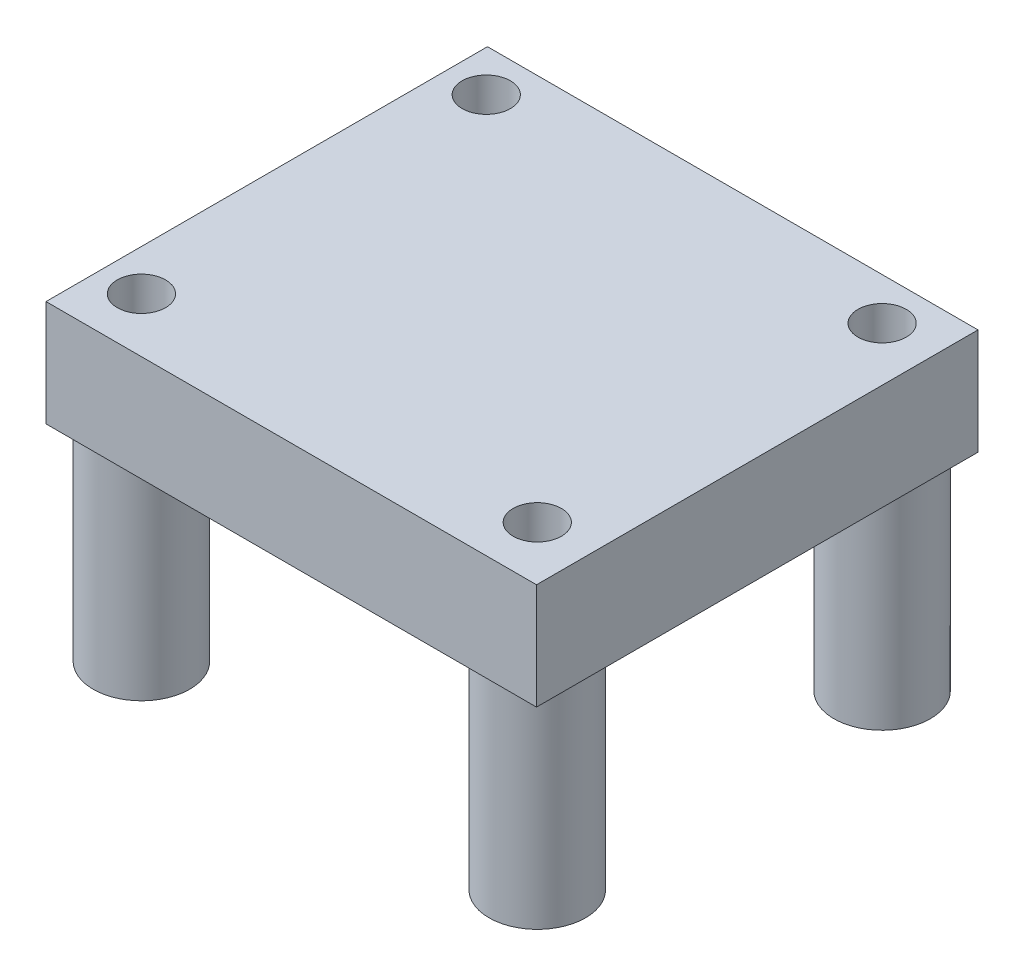
ISO-10303-21;
HEADER;
FILE_DESCRIPTION(('STEP AP214'),'2;1');
FILE_NAME('part.step','',(''),(''),'','','');
FILE_SCHEMA(('AUTOMOTIVE_DESIGN { 1 0 10303 214 1 1 1 1 }'));
ENDSEC;
DATA;
#1=APPLICATION_CONTEXT('core data for automotive mechanical design processes');
#2=APPLICATION_PROTOCOL_DEFINITION('international standard','automotive_design',2000,#1);
#3=PRODUCT_CONTEXT('',#1,'mechanical');
#4=PRODUCT('Part','Part','',(#3));
#5=PRODUCT_RELATED_PRODUCT_CATEGORY('part','',(#4));
#6=PRODUCT_DEFINITION_FORMATION('','',#4);
#7=PRODUCT_DEFINITION_CONTEXT('part definition',#1,'design');
#8=PRODUCT_DEFINITION('design','',#6,#7);
#9=PRODUCT_DEFINITION_SHAPE('','',#8);
#10=(LENGTH_UNIT() NAMED_UNIT(*) SI_UNIT(.MILLI.,.METRE.));
#11=(NAMED_UNIT(*) PLANE_ANGLE_UNIT() SI_UNIT($,.RADIAN.));
#12=(NAMED_UNIT(*) SI_UNIT($,.STERADIAN.) SOLID_ANGLE_UNIT());
#13=UNCERTAINTY_MEASURE_WITH_UNIT(LENGTH_MEASURE(1.E-05),#10,'distance_accuracy_value','');
#14=(GEOMETRIC_REPRESENTATION_CONTEXT(3) GLOBAL_UNCERTAINTY_ASSIGNED_CONTEXT((#13)) GLOBAL_UNIT_ASSIGNED_CONTEXT((#10,
#11,#12)) REPRESENTATION_CONTEXT('',''));
#15=CARTESIAN_POINT('',(0.,0.,0.));
#16=DIRECTION('',(0.,0.,1.));
#17=DIRECTION('',(1.,0.,0.));
#18=AXIS2_PLACEMENT_3D('',#15,#16,#17);
#19=CARTESIAN_POINT('',(0.,0.,0.));
#20=DIRECTION('',(0.,1.,0.));
#21=DIRECTION('',(0.,0.,1.));
#22=AXIS2_PLACEMENT_3D('',#19,#20,#21);
#23=PLANE('',#22);
#24=CARTESIAN_POINT('',(-31.9184975647169,0.,0.511660399212977));
#25=DIRECTION('',(0.,1.,0.));
#26=DIRECTION('',(0.,0.,1.));
#27=AXIS2_PLACEMENT_3D('',#24,#25,#26);
#28=CIRCLE('',#27,2.5);
#29=CARTESIAN_POINT('',(-34.0406995509559,0.,-0.809800432443963));
#30=VERTEX_POINT('',#29);
#31=CARTESIAN_POINT('',(-33.1337246748659,0.,-1.67311031433089));
#32=VERTEX_POINT('',#31);
#33=EDGE_CURVE('E45',#30,#32,#28,.F.);
#34=ORIENTED_EDGE('',*,*,#33,.F.);
#35=DIRECTION('',(0.,0.,1.));
#36=VECTOR('',#35,1.);
#37=CARTESIAN_POINT('',(-34.0406995509559,0.,-1.67311031433089));
#38=LINE('',#37,#36);
#39=CARTESIAN_POINT('',(-34.0406995509559,0.,-1.67311031433089));
#40=VERTEX_POINT('',#39);
#41=EDGE_CURVE('E164',#40,#30,#38,.T.);
#42=ORIENTED_EDGE('',*,*,#41,.F.);
#43=DIRECTION('',(-1.,0.,0.));
#44=VECTOR('',#43,1.);
#45=CARTESIAN_POINT('',(-8.64069955095587,0.,-1.67311031433089));
#46=LINE('',#45,#44);
#47=EDGE_CURVE('E60',#32,#40,#46,.T.);
#48=ORIENTED_EDGE('',*,*,#47,.F.);
#49=EDGE_LOOP('',(#34,#42,#48));
#50=FACE_BOUND('',#49,.T.);
#51=ADVANCED_FACE('F37',(#50),#23,.F.);
#52=CARTESIAN_POINT('',(-8.64069955095587,5.4864,-1.67311031433089));
#53=DIRECTION('',(0.,0.,1.));
#54=DIRECTION('',(1.,0.,0.));
#55=AXIS2_PLACEMENT_3D('',#52,#53,#54);
#56=PLANE('',#55);
#57=CARTESIAN_POINT('',(-8.64069955095587,0.,-1.67311031433089));
#58=VERTEX_POINT('',#57);
#59=CARTESIAN_POINT('',(-10.2054704545679,0.,-1.67311031433089));
#60=VERTEX_POINT('',#59);
#61=EDGE_CURVE('E107',#58,#60,#46,.T.);
#62=ORIENTED_EDGE('',*,*,#61,.T.);
#63=CARTESIAN_POINT('',(-12.6359246748659,0.,-1.67311031433089));
#64=VERTEX_POINT('',#63);
#65=EDGE_CURVE('E103',#60,#64,#46,.T.);
#66=ORIENTED_EDGE('',*,*,#65,.T.);
#67=CARTESIAN_POINT('',(-30.7032704545679,0.,-1.67311031433089));
#68=VERTEX_POINT('',#67);
#69=EDGE_CURVE('E104',#64,#68,#46,.T.);
#70=ORIENTED_EDGE('',*,*,#69,.T.);
#71=EDGE_CURVE('E117',#68,#32,#46,.T.);
#72=ORIENTED_EDGE('',*,*,#71,.T.);
#73=ORIENTED_EDGE('',*,*,#47,.T.);
#74=DIRECTION('',(0.,-1.,0.));
#75=VECTOR('',#74,1.);
#76=CARTESIAN_POINT('',(-34.0406995509559,5.4864,-1.67311031433089));
#77=LINE('',#76,#75);
#78=CARTESIAN_POINT('',(-34.0406995509559,5.4864,-1.67311031433089));
#79=VERTEX_POINT('',#78);
#80=EDGE_CURVE('E180',#79,#40,#77,.T.);
#81=ORIENTED_EDGE('',*,*,#80,.F.);
#82=DIRECTION('',(-1.,0.,0.));
#83=VECTOR('',#82,1.);
#84=CARTESIAN_POINT('',(-8.64069955095587,5.4864,-1.67311031433089));
#85=LINE('',#84,#83);
#86=CARTESIAN_POINT('',(-8.64069955095587,5.4864,-1.67311031433089));
#87=VERTEX_POINT('',#86);
#88=EDGE_CURVE('E152',#87,#79,#85,.T.);
#89=ORIENTED_EDGE('',*,*,#88,.F.);
#90=DIRECTION('',(0.,-1.,0.));
#91=VECTOR('',#90,1.);
#92=CARTESIAN_POINT('',(-8.64069955095587,5.4864,-1.67311031433089));
#93=LINE('',#92,#91);
#94=EDGE_CURVE('E161',#87,#58,#93,.T.);
#95=ORIENTED_EDGE('',*,*,#94,.T.);
#96=EDGE_LOOP('',(#62,#66,#70,#72,#73,#81,#89,#95));
#97=FACE_BOUND('',#96,.T.);
#98=ADVANCED_FACE('F39',(#97),#56,.F.);
#99=CARTESIAN_POINT('',(-34.0406995509559,5.4864,-1.67311031433089));
#100=DIRECTION('',(1.,0.,0.));
#101=DIRECTION('',(0.,0.,-1.));
#102=AXIS2_PLACEMENT_3D('',#99,#100,#101);
#103=PLANE('',#102);
#104=ORIENTED_EDGE('',*,*,#41,.T.);
#105=CARTESIAN_POINT('',(-34.0406995509559,0.,1.83312123086992));
#106=VERTEX_POINT('',#105);
#107=EDGE_CURVE('E168',#30,#106,#38,.T.);
#108=ORIENTED_EDGE('',*,*,#107,.T.);
#109=CARTESIAN_POINT('',(-34.0406995509559,0.,17.046399567556));
#110=VERTEX_POINT('',#109);
#111=EDGE_CURVE('E169',#106,#110,#38,.T.);
#112=ORIENTED_EDGE('',*,*,#111,.T.);
#113=CARTESIAN_POINT('',(-34.0406995509559,0.,19.6893212308699));
#114=VERTEX_POINT('',#113);
#115=EDGE_CURVE('E170',#110,#114,#38,.T.);
#116=ORIENTED_EDGE('',*,*,#115,.T.);
#117=CARTESIAN_POINT('',(-34.0406995509559,0.,21.1868896856691));
#118=VERTEX_POINT('',#117);
#119=EDGE_CURVE('E163',#114,#118,#38,.T.);
#120=ORIENTED_EDGE('',*,*,#119,.T.);
#121=DIRECTION('',(0.,-1.,0.));
#122=VECTOR('',#121,1.);
#123=CARTESIAN_POINT('',(-34.0406995509559,5.4864,21.1868896856691));
#124=LINE('',#123,#122);
#125=CARTESIAN_POINT('',(-34.0406995509559,5.4864,21.1868896856691));
#126=VERTEX_POINT('',#125);
#127=EDGE_CURVE('E177',#126,#118,#124,.T.);
#128=ORIENTED_EDGE('',*,*,#127,.F.);
#129=DIRECTION('',(0.,0.,1.));
#130=VECTOR('',#129,1.);
#131=CARTESIAN_POINT('',(-34.0406995509559,5.4864,-1.67311031433089));
#132=LINE('',#131,#130);
#133=EDGE_CURVE('E155',#79,#126,#132,.T.);
#134=ORIENTED_EDGE('',*,*,#133,.F.);
#135=ORIENTED_EDGE('',*,*,#80,.T.);
#136=EDGE_LOOP('',(#104,#108,#112,#116,#120,#128,#134,#135));
#137=FACE_BOUND('',#136,.T.);
#138=ADVANCED_FACE('F198',(#137),#103,.F.);
#139=CARTESIAN_POINT('',(-34.0406995509559,5.4864,21.1868896856691));
#140=DIRECTION('',(0.,0.,-1.));
#141=DIRECTION('',(-1.,0.,0.));
#142=AXIS2_PLACEMENT_3D('',#139,#140,#141);
#143=PLANE('',#142);
#144=DIRECTION('',(1.,0.,0.));
#145=VECTOR('',#144,1.);
#146=CARTESIAN_POINT('',(-34.0406995509559,0.,21.1868896856691));
#147=LINE('',#146,#145);
#148=CARTESIAN_POINT('',(-8.64069955095587,0.,21.1868896856691));
#149=VERTEX_POINT('',#148);
#150=EDGE_CURVE('E167',#118,#149,#147,.T.);
#151=ORIENTED_EDGE('',*,*,#150,.T.);
#152=DIRECTION('',(0.,-1.,0.));
#153=VECTOR('',#152,1.);
#154=CARTESIAN_POINT('',(-8.64069955095587,5.4864,21.1868896856691));
#155=LINE('',#154,#153);
#156=CARTESIAN_POINT('',(-8.64069955095587,5.4864,21.1868896856691));
#157=VERTEX_POINT('',#156);
#158=EDGE_CURVE('E174',#157,#149,#155,.T.);
#159=ORIENTED_EDGE('',*,*,#158,.F.);
#160=DIRECTION('',(1.,0.,0.));
#161=VECTOR('',#160,1.);
#162=CARTESIAN_POINT('',(-34.0406995509559,5.4864,21.1868896856691));
#163=LINE('',#162,#161);
#164=EDGE_CURVE('E158',#126,#157,#163,.T.);
#165=ORIENTED_EDGE('',*,*,#164,.F.);
#166=ORIENTED_EDGE('',*,*,#127,.T.);
#167=EDGE_LOOP('',(#151,#159,#165,#166));
#168=FACE_BOUND('',#167,.T.);
#169=ADVANCED_FACE('F219',(#168),#143,.F.);
#170=CARTESIAN_POINT('',(-8.64069955095587,5.4864,21.1868896856691));
#171=DIRECTION('',(-1.,0.,0.));
#172=DIRECTION('',(0.,0.,1.));
#173=AXIS2_PLACEMENT_3D('',#170,#171,#172);
#174=PLANE('',#173);
#175=DIRECTION('',(0.,0.,-1.));
#176=VECTOR('',#175,1.);
#177=CARTESIAN_POINT('',(-8.64069955095587,0.,21.1868896856691));
#178=LINE('',#177,#176);
#179=EDGE_CURVE('E156',#149,#58,#178,.T.);
#180=ORIENTED_EDGE('',*,*,#179,.T.);
#181=ORIENTED_EDGE('',*,*,#94,.F.);
#182=DIRECTION('',(0.,0.,-1.));
#183=VECTOR('',#182,1.);
#184=CARTESIAN_POINT('',(-8.64069955095587,5.4864,21.1868896856691));
#185=LINE('',#184,#183);
#186=EDGE_CURVE('E160',#157,#87,#185,.T.);
#187=ORIENTED_EDGE('',*,*,#186,.F.);
#188=ORIENTED_EDGE('',*,*,#158,.T.);
#189=EDGE_LOOP('',(#180,#181,#187,#188));
#190=FACE_BOUND('',#189,.T.);
#191=ADVANCED_FACE('F216',(#190),#174,.F.);
#192=CARTESIAN_POINT('',(0.,5.4864,0.));
#193=DIRECTION('',(0.,1.,0.));
#194=DIRECTION('',(0.,0.,1.));
#195=AXIS2_PLACEMENT_3D('',#192,#193,#194);
#196=PLANE('',#195);
#197=CARTESIAN_POINT('',(-31.9184975647169,5.4864,18.367860399213));
#198=DIRECTION('',(0.,1.,0.));
#199=DIRECTION('',(0.,0.,1.));
#200=AXIS2_PLACEMENT_3D('',#197,#198,#199);
#201=CIRCLE('',#200,1.25);
#202=CARTESIAN_POINT('',(-31.9184975647169,5.4864,19.617860399213));
#203=VERTEX_POINT('',#202);
#204=EDGE_CURVE('E303',#203,#203,#201,.T.);
#205=ORIENTED_EDGE('',*,*,#204,.F.);
#206=EDGE_LOOP('',(#205));
#207=FACE_BOUND('',#206,.T.);
#208=CARTESIAN_POINT('',(-11.4206975647169,5.4864,18.367860399213));
#209=DIRECTION('',(0.,1.,0.));
#210=DIRECTION('',(0.,0.,1.));
#211=AXIS2_PLACEMENT_3D('',#208,#209,#210);
#212=CIRCLE('',#211,1.25);
#213=CARTESIAN_POINT('',(-11.4206975647169,5.4864,19.617860399213));
#214=VERTEX_POINT('',#213);
#215=EDGE_CURVE('E314',#214,#214,#212,.T.);
#216=ORIENTED_EDGE('',*,*,#215,.F.);
#217=EDGE_LOOP('',(#216));
#218=FACE_BOUND('',#217,.T.);
#219=CARTESIAN_POINT('',(-11.4206975647169,5.4864,0.511660399212977));
#220=DIRECTION('',(0.,1.,0.));
#221=DIRECTION('',(0.,0.,1.));
#222=AXIS2_PLACEMENT_3D('',#219,#220,#221);
#223=CIRCLE('',#222,1.25);
#224=CARTESIAN_POINT('',(-11.4206975647169,5.4864,1.76166039921298));
#225=VERTEX_POINT('',#224);
#226=EDGE_CURVE('E309',#225,#225,#223,.T.);
#227=ORIENTED_EDGE('',*,*,#226,.F.);
#228=EDGE_LOOP('',(#227));
#229=FACE_BOUND('',#228,.T.);
#230=CARTESIAN_POINT('',(-31.9184975647169,5.4864,0.511660399212977));
#231=DIRECTION('',(0.,1.,0.));
#232=DIRECTION('',(0.,0.,1.));
#233=AXIS2_PLACEMENT_3D('',#230,#231,#232);
#234=CIRCLE('',#233,1.25);
#235=CARTESIAN_POINT('',(-31.9184975647169,5.4864,1.76166039921298));
#236=VERTEX_POINT('',#235);
#237=EDGE_CURVE('E305',#236,#236,#234,.T.);
#238=ORIENTED_EDGE('',*,*,#237,.F.);
#239=EDGE_LOOP('',(#238));
#240=FACE_BOUND('',#239,.T.);
#241=ORIENTED_EDGE('',*,*,#88,.T.);
#242=ORIENTED_EDGE('',*,*,#133,.T.);
#243=ORIENTED_EDGE('',*,*,#164,.T.);
#244=ORIENTED_EDGE('',*,*,#186,.T.);
#245=EDGE_LOOP('',(#241,#242,#243,#244));
#246=FACE_BOUND('',#245,.T.);
#247=ADVANCED_FACE('F210',(#207,#218,#229,#240,#246),#196,.T.);
#248=CARTESIAN_POINT('',(-11.4206975647169,0.,18.367860399213));
#249=DIRECTION('',(0.,1.,0.));
#250=DIRECTION('',(0.,0.,1.));
#251=AXIS2_PLACEMENT_3D('',#248,#249,#250);
#252=CIRCLE('',#251,2.5);
#253=CARTESIAN_POINT('',(-11.4206975647169,0.,20.867860399213));
#254=VERTEX_POINT('',#253);
#255=EDGE_CURVE('E11',#254,#254,#252,.F.);
#256=ORIENTED_EDGE('',*,*,#255,.F.);
#257=EDGE_LOOP('',(#256));
#258=FACE_BOUND('',#257,.T.);
#259=CARTESIAN_POINT('',(-11.4206975647169,0.,0.511660399212977));
#260=DIRECTION('',(0.,-1.,0.));
#261=DIRECTION('',(0.,0.,-1.));
#262=AXIS2_PLACEMENT_3D('',#259,#260,#261);
#263=CIRCLE('',#262,2.5);
#264=EDGE_CURVE('E52',#60,#64,#263,.T.);
#265=ORIENTED_EDGE('',*,*,#264,.F.);
#266=ORIENTED_EDGE('',*,*,#61,.F.);
#267=ORIENTED_EDGE('',*,*,#179,.F.);
#268=ORIENTED_EDGE('',*,*,#150,.F.);
#269=ORIENTED_EDGE('',*,*,#119,.F.);
#270=CARTESIAN_POINT('',(-31.9184975647169,0.,18.367860399213));
#271=DIRECTION('',(0.,-1.,0.));
#272=DIRECTION('',(0.,0.,-1.));
#273=AXIS2_PLACEMENT_3D('',#270,#271,#272);
#274=CIRCLE('',#273,2.5);
#275=EDGE_CURVE('E151',#110,#114,#274,.T.);
#276=ORIENTED_EDGE('',*,*,#275,.F.);
#277=ORIENTED_EDGE('',*,*,#111,.F.);
#278=CARTESIAN_POINT('',(-31.9184975647169,0.,0.511660399212977));
#279=DIRECTION('',(0.,-1.,0.));
#280=DIRECTION('',(0.,0.,-1.));
#281=AXIS2_PLACEMENT_3D('',#278,#279,#280);
#282=CIRCLE('',#281,2.5);
#283=EDGE_CURVE('E115',#68,#106,#282,.T.);
#284=ORIENTED_EDGE('',*,*,#283,.F.);
#285=ORIENTED_EDGE('',*,*,#69,.F.);
#286=EDGE_LOOP('',(#265,#266,#267,#268,#269,#276,#277,#284,#285));
#287=FACE_BOUND('',#286,.T.);
#288=ADVANCED_FACE('F112',(#258,#287),#23,.F.);
#289=CARTESIAN_POINT('',(-31.9184975647169,-11.,18.367860399213));
#290=DIRECTION('',(0.,-1.,0.));
#291=DIRECTION('',(0.,0.,-1.));
#292=AXIS2_PLACEMENT_3D('',#289,#290,#291);
#293=PLANE('',#292);
#294=CARTESIAN_POINT('',(-31.9184975647169,-11.,18.367860399213));
#295=DIRECTION('',(0.,-1.,0.));
#296=DIRECTION('',(0.,0.,-1.));
#297=AXIS2_PLACEMENT_3D('',#294,#295,#296);
#298=CIRCLE('',#297,2.5);
#299=CARTESIAN_POINT('',(-31.9184975647169,-11.,15.867860399213));
#300=VERTEX_POINT('',#299);
#301=EDGE_CURVE('E146',#300,#300,#298,.T.);
#302=ORIENTED_EDGE('',*,*,#301,.T.);
#303=EDGE_LOOP('',(#302));
#304=FACE_BOUND('',#303,.T.);
#305=CARTESIAN_POINT('',(-31.9184975647169,-11.,18.367860399213));
#306=DIRECTION('',(0.,-1.,0.));
#307=DIRECTION('',(0.,0.,-1.));
#308=AXIS2_PLACEMENT_3D('',#305,#306,#307);
#309=CIRCLE('',#308,1.25);
#310=CARTESIAN_POINT('',(-31.9184975647169,-11.,17.117860399213));
#311=VERTEX_POINT('',#310);
#312=EDGE_CURVE('E142',#311,#311,#309,.T.);
#313=ORIENTED_EDGE('',*,*,#312,.F.);
#314=EDGE_LOOP('',(#313));
#315=FACE_BOUND('',#314,.T.);
#316=ADVANCED_FACE('F234',(#304,#315),#293,.T.);
#317=CARTESIAN_POINT('',(-31.9184975647169,0.,18.367860399213));
#318=DIRECTION('',(0.,-1.,0.));
#319=DIRECTION('',(0.,0.,-1.));
#320=AXIS2_PLACEMENT_3D('',#317,#318,#319);
#321=PLANE('',#320);
#322=ORIENTED_EDGE('',*,*,#115,.F.);
#323=EDGE_CURVE('E145',#114,#110,#274,.T.);
#324=ORIENTED_EDGE('',*,*,#323,.F.);
#325=EDGE_LOOP('',(#322,#324));
#326=FACE_BOUND('',#325,.T.);
#327=ADVANCED_FACE('F194',(#326),#321,.F.);
#328=CARTESIAN_POINT('',(-31.9184975647169,-11.,18.367860399213));
#329=DIRECTION('',(0.,1.,0.));
#330=DIRECTION('',(0.,0.,1.));
#331=AXIS2_PLACEMENT_3D('',#328,#329,#330);
#332=CYLINDRICAL_SURFACE('',#331,2.5);
#333=ORIENTED_EDGE('',*,*,#301,.F.);
#334=EDGE_LOOP('',(#333));
#335=FACE_BOUND('',#334,.T.);
#336=ORIENTED_EDGE('',*,*,#323,.T.);
#337=ORIENTED_EDGE('',*,*,#275,.T.);
#338=EDGE_LOOP('',(#336,#337));
#339=FACE_BOUND('',#338,.T.);
#340=ADVANCED_FACE('F190',(#335,#339),#332,.T.);
#341=CARTESIAN_POINT('',(-31.9184975647169,-11.,18.367860399213));
#342=DIRECTION('',(0.,1.,0.));
#343=DIRECTION('',(0.,0.,1.));
#344=AXIS2_PLACEMENT_3D('',#341,#342,#343);
#345=CYLINDRICAL_SURFACE('',#344,1.25);
#346=ORIENTED_EDGE('',*,*,#312,.T.);
#347=EDGE_LOOP('',(#346));
#348=FACE_BOUND('',#347,.T.);
#349=ORIENTED_EDGE('',*,*,#204,.T.);
#350=EDGE_LOOP('',(#349));
#351=FACE_BOUND('',#350,.T.);
#352=ADVANCED_FACE('F281',(#348,#351),#345,.F.);
#353=CARTESIAN_POINT('',(-31.9184975647169,0.,0.511660399212977));
#354=DIRECTION('',(0.,-1.,0.));
#355=DIRECTION('',(0.,0.,-1.));
#356=AXIS2_PLACEMENT_3D('',#353,#354,#355);
#357=PLANE('',#356);
#358=EDGE_CURVE('E137',#32,#68,#282,.T.);
#359=ORIENTED_EDGE('',*,*,#358,.F.);
#360=ORIENTED_EDGE('',*,*,#71,.F.);
#361=EDGE_LOOP('',(#359,#360));
#362=FACE_BOUND('',#361,.T.);
#363=ADVANCED_FACE('F205',(#362),#357,.F.);
#364=EDGE_CURVE('E136',#106,#30,#282,.T.);
#365=ORIENTED_EDGE('',*,*,#364,.F.);
#366=ORIENTED_EDGE('',*,*,#107,.F.);
#367=EDGE_LOOP('',(#365,#366));
#368=FACE_BOUND('',#367,.T.);
#369=ADVANCED_FACE('F201',(#368),#357,.F.);
#370=CARTESIAN_POINT('',(-31.9184975647169,-11.,0.511660399212977));
#371=DIRECTION('',(0.,-1.,0.));
#372=DIRECTION('',(0.,0.,-1.));
#373=AXIS2_PLACEMENT_3D('',#370,#371,#372);
#374=PLANE('',#373);
#375=CARTESIAN_POINT('',(-31.9184975647169,-11.,0.511660399212977));
#376=DIRECTION('',(0.,-1.,0.));
#377=DIRECTION('',(0.,0.,-1.));
#378=AXIS2_PLACEMENT_3D('',#375,#376,#377);
#379=CIRCLE('',#378,2.5);
#380=CARTESIAN_POINT('',(-31.9184975647169,-11.,-1.98833960078702));
#381=VERTEX_POINT('',#380);
#382=EDGE_CURVE('E126',#381,#381,#379,.T.);
#383=ORIENTED_EDGE('',*,*,#382,.T.);
#384=EDGE_LOOP('',(#383));
#385=FACE_BOUND('',#384,.T.);
#386=CARTESIAN_POINT('',(-31.9184975647169,-11.,0.511660399212977));
#387=DIRECTION('',(0.,-1.,0.));
#388=DIRECTION('',(0.,0.,-1.));
#389=AXIS2_PLACEMENT_3D('',#386,#387,#388);
#390=CIRCLE('',#389,1.25);
#391=CARTESIAN_POINT('',(-31.9184975647169,-11.,-0.738339600787024));
#392=VERTEX_POINT('',#391);
#393=EDGE_CURVE('E135',#392,#392,#390,.T.);
#394=ORIENTED_EDGE('',*,*,#393,.F.);
#395=EDGE_LOOP('',(#394));
#396=FACE_BOUND('',#395,.T.);
#397=ADVANCED_FACE('F277',(#385,#396),#374,.T.);
#398=CARTESIAN_POINT('',(-31.9184975647169,-11.,0.511660399212977));
#399=DIRECTION('',(0.,1.,0.));
#400=DIRECTION('',(0.,0.,1.));
#401=AXIS2_PLACEMENT_3D('',#398,#399,#400);
#402=CYLINDRICAL_SURFACE('',#401,2.5);
#403=ORIENTED_EDGE('',*,*,#382,.F.);
#404=EDGE_LOOP('',(#403));
#405=FACE_BOUND('',#404,.T.);
#406=ORIENTED_EDGE('',*,*,#283,.T.);
#407=ORIENTED_EDGE('',*,*,#364,.T.);
#408=ORIENTED_EDGE('',*,*,#33,.T.);
#409=ORIENTED_EDGE('',*,*,#358,.T.);
#410=EDGE_LOOP('',(#406,#407,#408,#409));
#411=FACE_BOUND('',#410,.T.);
#412=ADVANCED_FACE('F202',(#405,#411),#402,.T.);
#413=CARTESIAN_POINT('',(-31.9184975647169,-11.,0.511660399212977));
#414=DIRECTION('',(0.,1.,0.));
#415=DIRECTION('',(0.,0.,1.));
#416=AXIS2_PLACEMENT_3D('',#413,#414,#415);
#417=CYLINDRICAL_SURFACE('',#416,1.25);
#418=ORIENTED_EDGE('',*,*,#393,.T.);
#419=EDGE_LOOP('',(#418));
#420=FACE_BOUND('',#419,.T.);
#421=ORIENTED_EDGE('',*,*,#237,.T.);
#422=EDGE_LOOP('',(#421));
#423=FACE_BOUND('',#422,.T.);
#424=ADVANCED_FACE('F268',(#420,#423),#417,.F.);
#425=CARTESIAN_POINT('',(-11.4206975647169,0.,0.511660399212977));
#426=DIRECTION('',(0.,-1.,0.));
#427=DIRECTION('',(0.,0.,-1.));
#428=AXIS2_PLACEMENT_3D('',#425,#426,#427);
#429=PLANE('',#428);
#430=EDGE_CURVE('E118',#64,#60,#263,.T.);
#431=ORIENTED_EDGE('',*,*,#430,.F.);
#432=ORIENTED_EDGE('',*,*,#65,.F.);
#433=EDGE_LOOP('',(#431,#432));
#434=FACE_BOUND('',#433,.T.);
#435=ADVANCED_FACE('F119',(#434),#429,.F.);
#436=CARTESIAN_POINT('',(-11.4206975647169,-11.,0.511660399212977));
#437=DIRECTION('',(0.,-1.,0.));
#438=DIRECTION('',(0.,0.,-1.));
#439=AXIS2_PLACEMENT_3D('',#436,#437,#438);
#440=PLANE('',#439);
#441=CARTESIAN_POINT('',(-11.4206975647169,-11.,0.511660399212977));
#442=DIRECTION('',(0.,-1.,0.));
#443=DIRECTION('',(0.,0.,-1.));
#444=AXIS2_PLACEMENT_3D('',#441,#442,#443);
#445=CIRCLE('',#444,2.5);
#446=CARTESIAN_POINT('',(-11.4206975647169,-11.,-1.98833960078702));
#447=VERTEX_POINT('',#446);
#448=EDGE_CURVE('E121',#447,#447,#445,.T.);
#449=ORIENTED_EDGE('',*,*,#448,.T.);
#450=EDGE_LOOP('',(#449));
#451=FACE_BOUND('',#450,.T.);
#452=CARTESIAN_POINT('',(-11.4206975647169,-11.,0.511660399212977));
#453=DIRECTION('',(0.,-1.,0.));
#454=DIRECTION('',(0.,0.,-1.));
#455=AXIS2_PLACEMENT_3D('',#452,#453,#454);
#456=CIRCLE('',#455,1.25);
#457=CARTESIAN_POINT('',(-11.4206975647169,-11.,-0.738339600787022));
#458=VERTEX_POINT('',#457);
#459=EDGE_CURVE('E124',#458,#458,#456,.T.);
#460=ORIENTED_EDGE('',*,*,#459,.F.);
#461=EDGE_LOOP('',(#460));
#462=FACE_BOUND('',#461,.T.);
#463=ADVANCED_FACE('F264',(#451,#462),#440,.T.);
#464=CARTESIAN_POINT('',(-11.4206975647169,-11.,0.511660399212977));
#465=DIRECTION('',(0.,1.,0.));
#466=DIRECTION('',(0.,0.,1.));
#467=AXIS2_PLACEMENT_3D('',#464,#465,#466);
#468=CYLINDRICAL_SURFACE('',#467,2.5);
#469=ORIENTED_EDGE('',*,*,#448,.F.);
#470=EDGE_LOOP('',(#469));
#471=FACE_BOUND('',#470,.T.);
#472=ORIENTED_EDGE('',*,*,#264,.T.);
#473=ORIENTED_EDGE('',*,*,#430,.T.);
#474=EDGE_LOOP('',(#472,#473));
#475=FACE_BOUND('',#474,.T.);
#476=ADVANCED_FACE('F123',(#471,#475),#468,.T.);
#477=CARTESIAN_POINT('',(-11.4206975647169,-11.,0.511660399212977));
#478=DIRECTION('',(0.,1.,0.));
#479=DIRECTION('',(0.,0.,1.));
#480=AXIS2_PLACEMENT_3D('',#477,#478,#479);
#481=CYLINDRICAL_SURFACE('',#480,1.25);
#482=ORIENTED_EDGE('',*,*,#459,.T.);
#483=EDGE_LOOP('',(#482));
#484=FACE_BOUND('',#483,.T.);
#485=ORIENTED_EDGE('',*,*,#226,.T.);
#486=EDGE_LOOP('',(#485));
#487=FACE_BOUND('',#486,.T.);
#488=ADVANCED_FACE('F257',(#484,#487),#481,.F.);
#489=CARTESIAN_POINT('',(-11.4206975647169,-11.,18.367860399213));
#490=DIRECTION('',(0.,-1.,0.));
#491=DIRECTION('',(0.,0.,-1.));
#492=AXIS2_PLACEMENT_3D('',#489,#490,#491);
#493=PLANE('',#492);
#494=CARTESIAN_POINT('',(-11.4206975647169,-11.,18.367860399213));
#495=DIRECTION('',(0.,-1.,0.));
#496=DIRECTION('',(0.,0.,-1.));
#497=AXIS2_PLACEMENT_3D('',#494,#495,#496);
#498=CIRCLE('',#497,2.5);
#499=CARTESIAN_POINT('',(-11.4206975647169,-11.,15.867860399213));
#500=VERTEX_POINT('',#499);
#501=EDGE_CURVE('E304',#500,#500,#498,.T.);
#502=ORIENTED_EDGE('',*,*,#501,.T.);
#503=EDGE_LOOP('',(#502));
#504=FACE_BOUND('',#503,.T.);
#505=CARTESIAN_POINT('',(-11.4206975647169,-11.,18.367860399213));
#506=DIRECTION('',(0.,-1.,0.));
#507=DIRECTION('',(0.,0.,-1.));
#508=AXIS2_PLACEMENT_3D('',#505,#506,#507);
#509=CIRCLE('',#508,1.25);
#510=CARTESIAN_POINT('',(-11.4206975647169,-11.,17.117860399213));
#511=VERTEX_POINT('',#510);
#512=EDGE_CURVE('E130',#511,#511,#509,.T.);
#513=ORIENTED_EDGE('',*,*,#512,.F.);
#514=EDGE_LOOP('',(#513));
#515=FACE_BOUND('',#514,.T.);
#516=ADVANCED_FACE('F248',(#504,#515),#493,.T.);
#517=CARTESIAN_POINT('',(-11.4206975647169,-11.,18.367860399213));
#518=DIRECTION('',(0.,1.,0.));
#519=DIRECTION('',(0.,0.,1.));
#520=AXIS2_PLACEMENT_3D('',#517,#518,#519);
#521=CYLINDRICAL_SURFACE('',#520,2.5);
#522=ORIENTED_EDGE('',*,*,#501,.F.);
#523=EDGE_LOOP('',(#522));
#524=FACE_BOUND('',#523,.T.);
#525=ORIENTED_EDGE('',*,*,#255,.T.);
#526=EDGE_LOOP('',(#525));
#527=FACE_BOUND('',#526,.T.);
#528=ADVANCED_FACE('F245',(#524,#527),#521,.T.);
#529=CARTESIAN_POINT('',(-11.4206975647169,-11.,18.367860399213));
#530=DIRECTION('',(0.,1.,0.));
#531=DIRECTION('',(0.,0.,1.));
#532=AXIS2_PLACEMENT_3D('',#529,#530,#531);
#533=CYLINDRICAL_SURFACE('',#532,1.25);
#534=ORIENTED_EDGE('',*,*,#512,.T.);
#535=EDGE_LOOP('',(#534));
#536=FACE_BOUND('',#535,.T.);
#537=ORIENTED_EDGE('',*,*,#215,.T.);
#538=EDGE_LOOP('',(#537));
#539=FACE_BOUND('',#538,.T.);
#540=ADVANCED_FACE('F247',(#536,#539),#533,.F.);
#541=CLOSED_SHELL('',(#51,#98,#138,#169,#191,#247,#288,#316,#327,#340,#352,#363,#369,#397,#412,
#424,#435,#463,#476,#488,#516,#528,#540));
#542=MANIFOLD_SOLID_BREP('B2',#541);
#543=ADVANCED_BREP_SHAPE_REPRESENTATION('',(#18,#542),#14);
#544=SHAPE_DEFINITION_REPRESENTATION(#9,#543);
ENDSEC;
END-ISO-10303-21;
